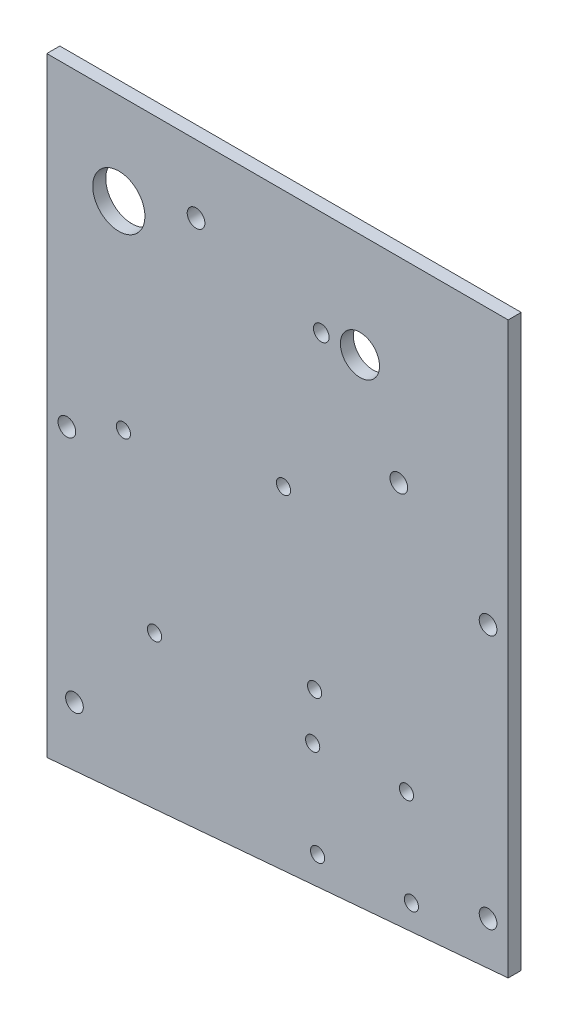
ISO-10303-21;
HEADER;
FILE_DESCRIPTION(('STEP AP214'),'2;1');
FILE_NAME('part.step','',(''),(''),'','','');
FILE_SCHEMA(('AUTOMOTIVE_DESIGN { 1 0 10303 214 1 1 1 1 }'));
ENDSEC;
DATA;
#1=APPLICATION_CONTEXT('core data for automotive mechanical design processes');
#2=APPLICATION_PROTOCOL_DEFINITION('international standard','automotive_design',2000,#1);
#3=PRODUCT_CONTEXT('',#1,'mechanical');
#4=PRODUCT('Part','Part','',(#3));
#5=PRODUCT_RELATED_PRODUCT_CATEGORY('part','',(#4));
#6=PRODUCT_DEFINITION_FORMATION('','',#4);
#7=PRODUCT_DEFINITION_CONTEXT('part definition',#1,'design');
#8=PRODUCT_DEFINITION('design','',#6,#7);
#9=PRODUCT_DEFINITION_SHAPE('','',#8);
#10=(LENGTH_UNIT() NAMED_UNIT(*) SI_UNIT(.MILLI.,.METRE.));
#11=(NAMED_UNIT(*) PLANE_ANGLE_UNIT() SI_UNIT($,.RADIAN.));
#12=(NAMED_UNIT(*) SI_UNIT($,.STERADIAN.) SOLID_ANGLE_UNIT());
#13=UNCERTAINTY_MEASURE_WITH_UNIT(LENGTH_MEASURE(1.E-05),#10,'distance_accuracy_value','');
#14=(GEOMETRIC_REPRESENTATION_CONTEXT(3) GLOBAL_UNCERTAINTY_ASSIGNED_CONTEXT((#13)) GLOBAL_UNIT_ASSIGNED_CONTEXT((#10,
#11,#12)) REPRESENTATION_CONTEXT('',''));
#15=CARTESIAN_POINT('',(0.,0.,0.));
#16=DIRECTION('',(0.,0.,1.));
#17=DIRECTION('',(1.,0.,0.));
#18=AXIS2_PLACEMENT_3D('',#15,#16,#17);
#19=CARTESIAN_POINT('',(112.268,-138.684,-3.175));
#20=DIRECTION('',(1.,0.,0.));
#21=DIRECTION('',(0.,1.,0.));
#22=AXIS2_PLACEMENT_3D('',#19,#20,#21);
#23=PLANE('',#22);
#24=DIRECTION('',(0.,1.,0.));
#25=VECTOR('',#24,1.);
#26=CARTESIAN_POINT('',(112.268,-138.684,0.));
#27=LINE('',#26,#25);
#28=CARTESIAN_POINT('',(112.268,-138.684,0.));
#29=VERTEX_POINT('',#28);
#30=CARTESIAN_POINT('',(112.268,0.,0.));
#31=VERTEX_POINT('',#30);
#32=EDGE_CURVE('E110',#29,#31,#27,.T.);
#33=ORIENTED_EDGE('',*,*,#32,.F.);
#34=DIRECTION('',(0.,0.,1.));
#35=VECTOR('',#34,1.);
#36=CARTESIAN_POINT('',(112.268,-138.684,-3.175));
#37=LINE('',#36,#35);
#38=CARTESIAN_POINT('',(112.268,-138.684,-3.175));
#39=VERTEX_POINT('',#38);
#40=EDGE_CURVE('E11',#39,#29,#37,.T.);
#41=ORIENTED_EDGE('',*,*,#40,.F.);
#42=DIRECTION('',(0.,1.,0.));
#43=VECTOR('',#42,1.);
#44=CARTESIAN_POINT('',(112.268,-138.684,-3.175));
#45=LINE('',#44,#43);
#46=CARTESIAN_POINT('',(112.268,0.,-3.175));
#47=VERTEX_POINT('',#46);
#48=EDGE_CURVE('E101',#39,#47,#45,.T.);
#49=ORIENTED_EDGE('',*,*,#48,.T.);
#50=DIRECTION('',(0.,0.,1.));
#51=VECTOR('',#50,1.);
#52=CARTESIAN_POINT('',(112.268,0.,-3.175));
#53=LINE('',#52,#51);
#54=EDGE_CURVE('E42',#47,#31,#53,.T.);
#55=ORIENTED_EDGE('',*,*,#54,.T.);
#56=EDGE_LOOP('',(#33,#41,#49,#55));
#57=FACE_BOUND('',#56,.T.);
#58=ADVANCED_FACE('F39',(#57),#23,.T.);
#59=CARTESIAN_POINT('',(0.,-148.336,-3.175));
#60=DIRECTION('',(0.0856568743177185,-0.996324696011355,0.));
#61=DIRECTION('',(0.996324696011355,0.0856568743177185,0.));
#62=AXIS2_PLACEMENT_3D('',#59,#60,#61);
#63=PLANE('',#62);
#64=DIRECTION('',(0.996324696011355,0.0856568743177185,0.));
#65=VECTOR('',#64,1.);
#66=CARTESIAN_POINT('',(0.,-148.336,0.));
#67=LINE('',#66,#65);
#68=CARTESIAN_POINT('',(0.,-148.336,0.));
#69=VERTEX_POINT('',#68);
#70=EDGE_CURVE('E104',#69,#29,#67,.T.);
#71=ORIENTED_EDGE('',*,*,#70,.F.);
#72=DIRECTION('',(0.,0.,1.));
#73=VECTOR('',#72,1.);
#74=CARTESIAN_POINT('',(0.,-148.336,-3.175));
#75=LINE('',#74,#73);
#76=CARTESIAN_POINT('',(0.,-148.336,-3.175));
#77=VERTEX_POINT('',#76);
#78=EDGE_CURVE('E49',#77,#69,#75,.T.);
#79=ORIENTED_EDGE('',*,*,#78,.F.);
#80=DIRECTION('',(0.996324696011355,0.0856568743177185,0.));
#81=VECTOR('',#80,1.);
#82=CARTESIAN_POINT('',(0.,-148.336,-3.175));
#83=LINE('',#82,#81);
#84=EDGE_CURVE('E96',#77,#39,#83,.T.);
#85=ORIENTED_EDGE('',*,*,#84,.T.);
#86=ORIENTED_EDGE('',*,*,#40,.T.);
#87=EDGE_LOOP('',(#71,#79,#85,#86));
#88=FACE_BOUND('',#87,.T.);
#89=ADVANCED_FACE('F127',(#88),#63,.T.);
#90=CARTESIAN_POINT('',(0.,0.,-3.175));
#91=DIRECTION('',(-1.,0.,0.));
#92=DIRECTION('',(0.,0.,1.));
#93=AXIS2_PLACEMENT_3D('',#90,#91,#92);
#94=PLANE('',#93);
#95=DIRECTION('',(0.,-1.,0.));
#96=VECTOR('',#95,1.);
#97=CARTESIAN_POINT('',(0.,0.,0.));
#98=LINE('',#97,#96);
#99=CARTESIAN_POINT('',(0.,0.,0.));
#100=VERTEX_POINT('',#99);
#101=EDGE_CURVE('E90',#100,#69,#98,.T.);
#102=ORIENTED_EDGE('',*,*,#101,.F.);
#103=DIRECTION('',(0.,0.,1.));
#104=VECTOR('',#103,1.);
#105=CARTESIAN_POINT('',(0.,0.,-3.175));
#106=LINE('',#105,#104);
#107=CARTESIAN_POINT('',(0.,0.,-3.175));
#108=VERTEX_POINT('',#107);
#109=EDGE_CURVE('E85',#108,#100,#106,.T.);
#110=ORIENTED_EDGE('',*,*,#109,.F.);
#111=DIRECTION('',(0.,-1.,0.));
#112=VECTOR('',#111,1.);
#113=CARTESIAN_POINT('',(0.,0.,-3.175));
#114=LINE('',#113,#112);
#115=EDGE_CURVE('E88',#108,#77,#114,.T.);
#116=ORIENTED_EDGE('',*,*,#115,.T.);
#117=ORIENTED_EDGE('',*,*,#78,.T.);
#118=EDGE_LOOP('',(#102,#110,#116,#117));
#119=FACE_BOUND('',#118,.T.);
#120=ADVANCED_FACE('F87',(#119),#94,.T.);
#121=CARTESIAN_POINT('',(112.268,0.,-3.175));
#122=DIRECTION('',(0.,1.,0.));
#123=DIRECTION('',(0.,0.,1.));
#124=AXIS2_PLACEMENT_3D('',#121,#122,#123);
#125=PLANE('',#124);
#126=DIRECTION('',(-1.,0.,0.));
#127=VECTOR('',#126,1.);
#128=CARTESIAN_POINT('',(112.268,0.,0.));
#129=LINE('',#128,#127);
#130=EDGE_CURVE('E114',#31,#100,#129,.T.);
#131=ORIENTED_EDGE('',*,*,#130,.F.);
#132=ORIENTED_EDGE('',*,*,#54,.F.);
#133=DIRECTION('',(-1.,0.,0.));
#134=VECTOR('',#133,1.);
#135=CARTESIAN_POINT('',(112.268,0.,-3.175));
#136=LINE('',#135,#134);
#137=EDGE_CURVE('E95',#47,#108,#136,.T.);
#138=ORIENTED_EDGE('',*,*,#137,.T.);
#139=ORIENTED_EDGE('',*,*,#109,.T.);
#140=EDGE_LOOP('',(#131,#132,#138,#139));
#141=FACE_BOUND('',#140,.T.);
#142=ADVANCED_FACE('F99',(#141),#125,.T.);
#143=CARTESIAN_POINT('',(0.,0.,-3.175));
#144=DIRECTION('',(0.,0.,1.));
#145=DIRECTION('',(1.,0.,0.));
#146=AXIS2_PLACEMENT_3D('',#143,#144,#145);
#147=PLANE('',#146);
#148=CARTESIAN_POINT('',(66.7920278286556,-25.4583547335072,-3.175));
#149=DIRECTION('',(0.,0.,-1.));
#150=DIRECTION('',(-1.,0.,0.));
#151=AXIS2_PLACEMENT_3D('',#148,#149,#150);
#152=CIRCLE('',#151,1.90500000000002);
#153=CARTESIAN_POINT('',(64.8870278286556,-25.4583547335072,-3.175));
#154=VERTEX_POINT('',#153);
#155=EDGE_CURVE('E223',#154,#154,#152,.T.);
#156=ORIENTED_EDGE('',*,*,#155,.F.);
#157=EDGE_LOOP('',(#156));
#158=FACE_BOUND('',#157,.T.);
#159=CARTESIAN_POINT('',(17.526,-22.352,-3.175));
#160=DIRECTION('',(0.,0.,1.));
#161=DIRECTION('',(1.,0.,0.));
#162=AXIS2_PLACEMENT_3D('',#159,#160,#161);
#163=CIRCLE('',#162,6.35);
#164=CARTESIAN_POINT('',(23.876,-22.352,-3.175));
#165=VERTEX_POINT('',#164);
#166=EDGE_CURVE('E233',#165,#165,#163,.T.);
#167=ORIENTED_EDGE('',*,*,#166,.T.);
#168=EDGE_LOOP('',(#167));
#169=FACE_BOUND('',#168,.T.);
#170=CARTESIAN_POINT('',(76.2,-25.4,-3.175));
#171=DIRECTION('',(0.,0.,1.));
#172=DIRECTION('',(1.,0.,0.));
#173=AXIS2_PLACEMENT_3D('',#170,#171,#172);
#174=CIRCLE('',#173,4.7625);
#175=CARTESIAN_POINT('',(80.9625,-25.4,-3.175));
#176=VERTEX_POINT('',#175);
#177=EDGE_CURVE('E241',#176,#176,#174,.T.);
#178=ORIENTED_EDGE('',*,*,#177,.T.);
#179=EDGE_LOOP('',(#178));
#180=FACE_BOUND('',#179,.T.);
#181=CARTESIAN_POINT('',(36.322,-16.51,-3.175));
#182=DIRECTION('',(0.,0.,1.));
#183=DIRECTION('',(1.,0.,0.));
#184=AXIS2_PLACEMENT_3D('',#181,#182,#183);
#185=CIRCLE('',#184,2.15265);
#186=CARTESIAN_POINT('',(38.47465,-16.51,-3.175));
#187=VERTEX_POINT('',#186);
#188=EDGE_CURVE('E249',#187,#187,#185,.T.);
#189=ORIENTED_EDGE('',*,*,#188,.T.);
#190=EDGE_LOOP('',(#189));
#191=FACE_BOUND('',#190,.T.);
#192=CARTESIAN_POINT('',(85.6615,-47.625,-3.175));
#193=DIRECTION('',(0.,0.,1.));
#194=DIRECTION('',(1.,0.,0.));
#195=AXIS2_PLACEMENT_3D('',#192,#193,#194);
#196=CIRCLE('',#195,2.15264999999999);
#197=CARTESIAN_POINT('',(87.81415,-47.625,-3.175));
#198=VERTEX_POINT('',#197);
#199=EDGE_CURVE('E257',#198,#198,#196,.T.);
#200=ORIENTED_EDGE('',*,*,#199,.T.);
#201=EDGE_LOOP('',(#200));
#202=FACE_BOUND('',#201,.T.);
#203=CARTESIAN_POINT('',(18.6444695764577,-70.032201580464,-3.175));
#204=DIRECTION('',(0.,0.,1.));
#205=DIRECTION('',(1.,0.,0.));
#206=AXIS2_PLACEMENT_3D('',#203,#204,#205);
#207=CIRCLE('',#206,1.72719999999999);
#208=CARTESIAN_POINT('',(20.3716695764577,-70.032201580464,-3.175));
#209=VERTEX_POINT('',#208);
#210=EDGE_CURVE('E265',#209,#209,#207,.T.);
#211=ORIENTED_EDGE('',*,*,#210,.T.);
#212=EDGE_LOOP('',(#211));
#213=FACE_BOUND('',#212,.T.);
#214=CARTESIAN_POINT('',(57.602798419536,-62.4594695764574,-3.175));
#215=DIRECTION('',(0.,0.,1.));
#216=DIRECTION('',(1.,0.,0.));
#217=AXIS2_PLACEMENT_3D('',#214,#215,#216);
#218=CIRCLE('',#217,1.7272);
#219=CARTESIAN_POINT('',(59.329998419536,-62.4594695764574,-3.175));
#220=VERTEX_POINT('',#219);
#221=EDGE_CURVE('E273',#220,#220,#218,.T.);
#222=ORIENTED_EDGE('',*,*,#221,.T.);
#223=EDGE_LOOP('',(#222));
#224=FACE_BOUND('',#223,.T.);
#225=CARTESIAN_POINT('',(65.1755304235415,-101.417798419535,-3.175));
#226=DIRECTION('',(0.,0.,1.));
#227=DIRECTION('',(1.,0.,0.));
#228=AXIS2_PLACEMENT_3D('',#225,#226,#227);
#229=CIRCLE('',#228,1.7272);
#230=CARTESIAN_POINT('',(66.9027304235415,-101.417798419535,-3.175));
#231=VERTEX_POINT('',#230);
#232=EDGE_CURVE('E281',#231,#231,#229,.T.);
#233=ORIENTED_EDGE('',*,*,#232,.T.);
#234=EDGE_LOOP('',(#233));
#235=FACE_BOUND('',#234,.T.);
#236=CARTESIAN_POINT('',(26.217201580465,-108.990530423541,-3.175));
#237=DIRECTION('',(0.,0.,1.));
#238=DIRECTION('',(1.,0.,0.));
#239=AXIS2_PLACEMENT_3D('',#236,#237,#238);
#240=CIRCLE('',#239,1.72719999999999);
#241=CARTESIAN_POINT('',(27.944401580465,-108.990530423541,-3.175));
#242=VERTEX_POINT('',#241);
#243=EDGE_CURVE('E289',#242,#242,#240,.T.);
#244=ORIENTED_EDGE('',*,*,#243,.T.);
#245=EDGE_LOOP('',(#244));
#246=FACE_BOUND('',#245,.T.);
#247=CARTESIAN_POINT('',(65.8918643976101,-135.8375355621,-3.175));
#248=DIRECTION('',(0.,0.,1.));
#249=DIRECTION('',(1.,0.,0.));
#250=AXIS2_PLACEMENT_3D('',#247,#248,#249);
#251=CIRCLE('',#250,1.7272);
#252=CARTESIAN_POINT('',(67.6190643976101,-135.8375355621,-3.175));
#253=VERTEX_POINT('',#252);
#254=EDGE_CURVE('E297',#253,#253,#251,.T.);
#255=ORIENTED_EDGE('',*,*,#254,.T.);
#256=EDGE_LOOP('',(#255));
#257=FACE_BOUND('',#256,.T.);
#258=CARTESIAN_POINT('',(88.7205355621015,-134.641135602388,-3.175));
#259=DIRECTION('',(0.,0.,1.));
#260=DIRECTION('',(1.,0.,0.));
#261=AXIS2_PLACEMENT_3D('',#258,#259,#260);
#262=CIRCLE('',#261,1.7272);
#263=CARTESIAN_POINT('',(90.4477355621015,-134.641135602388,-3.175));
#264=VERTEX_POINT('',#263);
#265=EDGE_CURVE('E305',#264,#264,#262,.T.);
#266=ORIENTED_EDGE('',*,*,#265,.T.);
#267=EDGE_LOOP('',(#266));
#268=FACE_BOUND('',#267,.T.);
#269=CARTESIAN_POINT('',(87.5241356023876,-111.812464437898,-3.175));
#270=DIRECTION('',(0.,0.,1.));
#271=DIRECTION('',(1.,0.,0.));
#272=AXIS2_PLACEMENT_3D('',#269,#270,#271);
#273=CIRCLE('',#272,1.7272);
#274=CARTESIAN_POINT('',(89.2513356023876,-111.812464437898,-3.175));
#275=VERTEX_POINT('',#274);
#276=EDGE_CURVE('E313',#275,#275,#273,.T.);
#277=ORIENTED_EDGE('',*,*,#276,.T.);
#278=EDGE_LOOP('',(#277));
#279=FACE_BOUND('',#278,.T.);
#280=CARTESIAN_POINT('',(64.6954644378985,-113.008864397612,-3.175));
#281=DIRECTION('',(0.,0.,1.));
#282=DIRECTION('',(1.,0.,0.));
#283=AXIS2_PLACEMENT_3D('',#280,#281,#282);
#284=CIRCLE('',#283,1.7272);
#285=CARTESIAN_POINT('',(66.4226644378984,-113.008864397612,-3.175));
#286=VERTEX_POINT('',#285);
#287=EDGE_CURVE('E321',#286,#286,#284,.T.);
#288=ORIENTED_EDGE('',*,*,#287,.T.);
#289=EDGE_LOOP('',(#288));
#290=FACE_BOUND('',#289,.T.);
#291=CARTESIAN_POINT('',(6.731,-133.35,-3.175));
#292=DIRECTION('',(0.,0.,1.));
#293=DIRECTION('',(1.,0.,0.));
#294=AXIS2_PLACEMENT_3D('',#291,#292,#293);
#295=CIRCLE('',#294,2.15265);
#296=CARTESIAN_POINT('',(8.88365,-133.35,-3.175));
#297=VERTEX_POINT('',#296);
#298=EDGE_CURVE('E329',#297,#297,#295,.T.);
#299=ORIENTED_EDGE('',*,*,#298,.T.);
#300=EDGE_LOOP('',(#299));
#301=FACE_BOUND('',#300,.T.);
#302=CARTESIAN_POINT('',(107.3785,-128.5875,-3.175));
#303=DIRECTION('',(0.,0.,1.));
#304=DIRECTION('',(1.,0.,0.));
#305=AXIS2_PLACEMENT_3D('',#302,#303,#304);
#306=CIRCLE('',#305,2.15264999999999);
#307=CARTESIAN_POINT('',(109.53115,-128.5875,-3.175));
#308=VERTEX_POINT('',#307);
#309=EDGE_CURVE('E337',#308,#308,#306,.T.);
#310=ORIENTED_EDGE('',*,*,#309,.T.);
#311=EDGE_LOOP('',(#310));
#312=FACE_BOUND('',#311,.T.);
#313=CARTESIAN_POINT('',(107.3785,-66.675,-3.175));
#314=DIRECTION('',(0.,0.,1.));
#315=DIRECTION('',(1.,0.,0.));
#316=AXIS2_PLACEMENT_3D('',#313,#314,#315);
#317=CIRCLE('',#316,2.15264999999999);
#318=CARTESIAN_POINT('',(109.53115,-66.675,-3.175));
#319=VERTEX_POINT('',#318);
#320=EDGE_CURVE('E345',#319,#319,#317,.T.);
#321=ORIENTED_EDGE('',*,*,#320,.T.);
#322=EDGE_LOOP('',(#321));
#323=FACE_BOUND('',#322,.T.);
#324=CARTESIAN_POINT('',(4.8895,-76.2,-3.175));
#325=DIRECTION('',(0.,0.,1.));
#326=DIRECTION('',(1.,0.,0.));
#327=AXIS2_PLACEMENT_3D('',#324,#325,#326);
#328=CIRCLE('',#327,2.15265);
#329=CARTESIAN_POINT('',(7.04215,-76.2,-3.175));
#330=VERTEX_POINT('',#329);
#331=EDGE_CURVE('E115',#330,#330,#328,.T.);
#332=ORIENTED_EDGE('',*,*,#331,.T.);
#333=EDGE_LOOP('',(#332));
#334=FACE_BOUND('',#333,.T.);
#335=ORIENTED_EDGE('',*,*,#48,.F.);
#336=ORIENTED_EDGE('',*,*,#84,.F.);
#337=ORIENTED_EDGE('',*,*,#115,.F.);
#338=ORIENTED_EDGE('',*,*,#137,.F.);
#339=EDGE_LOOP('',(#335,#336,#337,#338));
#340=FACE_BOUND('',#339,.T.);
#341=ADVANCED_FACE('F94',(#158,#169,#180,#191,#202,#213,#224,#235,#246,#257,#268,#279,#290,#301,
#312,#323,#334,#340),#147,.F.);
#342=CARTESIAN_POINT('',(0.,0.,0.));
#343=DIRECTION('',(0.,0.,1.));
#344=DIRECTION('',(1.,0.,0.));
#345=AXIS2_PLACEMENT_3D('',#342,#343,#344);
#346=PLANE('',#345);
#347=CARTESIAN_POINT('',(66.7920278286556,-25.4583547335072,0.));
#348=DIRECTION('',(0.,0.,-1.));
#349=DIRECTION('',(-1.,0.,0.));
#350=AXIS2_PLACEMENT_3D('',#347,#348,#349);
#351=CIRCLE('',#350,1.90500000000002);
#352=CARTESIAN_POINT('',(64.8870278286556,-25.4583547335072,0.));
#353=VERTEX_POINT('',#352);
#354=EDGE_CURVE('E221',#353,#353,#351,.T.);
#355=ORIENTED_EDGE('',*,*,#354,.T.);
#356=EDGE_LOOP('',(#355));
#357=FACE_BOUND('',#356,.T.);
#358=CARTESIAN_POINT('',(17.526,-22.352,0.));
#359=DIRECTION('',(0.,0.,1.));
#360=DIRECTION('',(1.,0.,0.));
#361=AXIS2_PLACEMENT_3D('',#358,#359,#360);
#362=CIRCLE('',#361,6.35);
#363=CARTESIAN_POINT('',(23.876,-22.352,0.));
#364=VERTEX_POINT('',#363);
#365=EDGE_CURVE('E227',#364,#364,#362,.T.);
#366=ORIENTED_EDGE('',*,*,#365,.F.);
#367=EDGE_LOOP('',(#366));
#368=FACE_BOUND('',#367,.T.);
#369=CARTESIAN_POINT('',(76.2,-25.4,0.));
#370=DIRECTION('',(0.,0.,1.));
#371=DIRECTION('',(1.,0.,0.));
#372=AXIS2_PLACEMENT_3D('',#369,#370,#371);
#373=CIRCLE('',#372,4.7625);
#374=CARTESIAN_POINT('',(80.9625,-25.4,0.));
#375=VERTEX_POINT('',#374);
#376=EDGE_CURVE('E237',#375,#375,#373,.T.);
#377=ORIENTED_EDGE('',*,*,#376,.F.);
#378=EDGE_LOOP('',(#377));
#379=FACE_BOUND('',#378,.T.);
#380=CARTESIAN_POINT('',(36.322,-16.51,0.));
#381=DIRECTION('',(0.,0.,1.));
#382=DIRECTION('',(1.,0.,0.));
#383=AXIS2_PLACEMENT_3D('',#380,#381,#382);
#384=CIRCLE('',#383,2.15265);
#385=CARTESIAN_POINT('',(38.47465,-16.51,0.));
#386=VERTEX_POINT('',#385);
#387=EDGE_CURVE('E245',#386,#386,#384,.T.);
#388=ORIENTED_EDGE('',*,*,#387,.F.);
#389=EDGE_LOOP('',(#388));
#390=FACE_BOUND('',#389,.T.);
#391=CARTESIAN_POINT('',(85.6615,-47.625,0.));
#392=DIRECTION('',(0.,0.,1.));
#393=DIRECTION('',(1.,0.,0.));
#394=AXIS2_PLACEMENT_3D('',#391,#392,#393);
#395=CIRCLE('',#394,2.15264999999999);
#396=CARTESIAN_POINT('',(87.81415,-47.625,0.));
#397=VERTEX_POINT('',#396);
#398=EDGE_CURVE('E253',#397,#397,#395,.T.);
#399=ORIENTED_EDGE('',*,*,#398,.F.);
#400=EDGE_LOOP('',(#399));
#401=FACE_BOUND('',#400,.T.);
#402=CARTESIAN_POINT('',(18.6444695764577,-70.032201580464,0.));
#403=DIRECTION('',(0.,0.,1.));
#404=DIRECTION('',(1.,0.,0.));
#405=AXIS2_PLACEMENT_3D('',#402,#403,#404);
#406=CIRCLE('',#405,1.7272);
#407=CARTESIAN_POINT('',(20.3716695764577,-70.032201580464,0.));
#408=VERTEX_POINT('',#407);
#409=EDGE_CURVE('E261',#408,#408,#406,.T.);
#410=ORIENTED_EDGE('',*,*,#409,.F.);
#411=EDGE_LOOP('',(#410));
#412=FACE_BOUND('',#411,.T.);
#413=CARTESIAN_POINT('',(57.602798419536,-62.4594695764574,0.));
#414=DIRECTION('',(0.,0.,1.));
#415=DIRECTION('',(1.,0.,0.));
#416=AXIS2_PLACEMENT_3D('',#413,#414,#415);
#417=CIRCLE('',#416,1.7272);
#418=CARTESIAN_POINT('',(59.329998419536,-62.4594695764574,0.));
#419=VERTEX_POINT('',#418);
#420=EDGE_CURVE('E269',#419,#419,#417,.T.);
#421=ORIENTED_EDGE('',*,*,#420,.F.);
#422=EDGE_LOOP('',(#421));
#423=FACE_BOUND('',#422,.T.);
#424=CARTESIAN_POINT('',(65.1755304235415,-101.417798419535,0.));
#425=DIRECTION('',(0.,0.,1.));
#426=DIRECTION('',(1.,0.,0.));
#427=AXIS2_PLACEMENT_3D('',#424,#425,#426);
#428=CIRCLE('',#427,1.7272);
#429=CARTESIAN_POINT('',(66.9027304235415,-101.417798419535,0.));
#430=VERTEX_POINT('',#429);
#431=EDGE_CURVE('E277',#430,#430,#428,.T.);
#432=ORIENTED_EDGE('',*,*,#431,.F.);
#433=EDGE_LOOP('',(#432));
#434=FACE_BOUND('',#433,.T.);
#435=CARTESIAN_POINT('',(26.217201580465,-108.990530423541,0.));
#436=DIRECTION('',(0.,0.,1.));
#437=DIRECTION('',(1.,0.,0.));
#438=AXIS2_PLACEMENT_3D('',#435,#436,#437);
#439=CIRCLE('',#438,1.7272);
#440=CARTESIAN_POINT('',(27.944401580465,-108.990530423541,0.));
#441=VERTEX_POINT('',#440);
#442=EDGE_CURVE('E285',#441,#441,#439,.T.);
#443=ORIENTED_EDGE('',*,*,#442,.F.);
#444=EDGE_LOOP('',(#443));
#445=FACE_BOUND('',#444,.T.);
#446=CARTESIAN_POINT('',(65.8918643976101,-135.8375355621,0.));
#447=DIRECTION('',(0.,0.,1.));
#448=DIRECTION('',(1.,0.,0.));
#449=AXIS2_PLACEMENT_3D('',#446,#447,#448);
#450=CIRCLE('',#449,1.7272);
#451=CARTESIAN_POINT('',(67.6190643976101,-135.8375355621,0.));
#452=VERTEX_POINT('',#451);
#453=EDGE_CURVE('E293',#452,#452,#450,.T.);
#454=ORIENTED_EDGE('',*,*,#453,.F.);
#455=EDGE_LOOP('',(#454));
#456=FACE_BOUND('',#455,.T.);
#457=CARTESIAN_POINT('',(88.7205355621015,-134.641135602388,0.));
#458=DIRECTION('',(0.,0.,1.));
#459=DIRECTION('',(1.,0.,0.));
#460=AXIS2_PLACEMENT_3D('',#457,#458,#459);
#461=CIRCLE('',#460,1.7272);
#462=CARTESIAN_POINT('',(90.4477355621015,-134.641135602388,0.));
#463=VERTEX_POINT('',#462);
#464=EDGE_CURVE('E301',#463,#463,#461,.T.);
#465=ORIENTED_EDGE('',*,*,#464,.F.);
#466=EDGE_LOOP('',(#465));
#467=FACE_BOUND('',#466,.T.);
#468=CARTESIAN_POINT('',(87.5241356023876,-111.812464437898,0.));
#469=DIRECTION('',(0.,0.,1.));
#470=DIRECTION('',(1.,0.,0.));
#471=AXIS2_PLACEMENT_3D('',#468,#469,#470);
#472=CIRCLE('',#471,1.7272);
#473=CARTESIAN_POINT('',(89.2513356023876,-111.812464437898,0.));
#474=VERTEX_POINT('',#473);
#475=EDGE_CURVE('E309',#474,#474,#472,.T.);
#476=ORIENTED_EDGE('',*,*,#475,.F.);
#477=EDGE_LOOP('',(#476));
#478=FACE_BOUND('',#477,.T.);
#479=CARTESIAN_POINT('',(64.6954644378985,-113.008864397612,0.));
#480=DIRECTION('',(0.,0.,1.));
#481=DIRECTION('',(1.,0.,0.));
#482=AXIS2_PLACEMENT_3D('',#479,#480,#481);
#483=CIRCLE('',#482,1.7272);
#484=CARTESIAN_POINT('',(66.4226644378984,-113.008864397612,0.));
#485=VERTEX_POINT('',#484);
#486=EDGE_CURVE('E317',#485,#485,#483,.T.);
#487=ORIENTED_EDGE('',*,*,#486,.F.);
#488=EDGE_LOOP('',(#487));
#489=FACE_BOUND('',#488,.T.);
#490=CARTESIAN_POINT('',(6.731,-133.35,0.));
#491=DIRECTION('',(0.,0.,1.));
#492=DIRECTION('',(1.,0.,0.));
#493=AXIS2_PLACEMENT_3D('',#490,#491,#492);
#494=CIRCLE('',#493,2.15264999999999);
#495=CARTESIAN_POINT('',(8.88364999999999,-133.35,0.));
#496=VERTEX_POINT('',#495);
#497=EDGE_CURVE('E325',#496,#496,#494,.T.);
#498=ORIENTED_EDGE('',*,*,#497,.F.);
#499=EDGE_LOOP('',(#498));
#500=FACE_BOUND('',#499,.T.);
#501=CARTESIAN_POINT('',(107.3785,-128.5875,0.));
#502=DIRECTION('',(0.,0.,1.));
#503=DIRECTION('',(1.,0.,0.));
#504=AXIS2_PLACEMENT_3D('',#501,#502,#503);
#505=CIRCLE('',#504,2.15264999999999);
#506=CARTESIAN_POINT('',(109.53115,-128.5875,0.));
#507=VERTEX_POINT('',#506);
#508=EDGE_CURVE('E333',#507,#507,#505,.T.);
#509=ORIENTED_EDGE('',*,*,#508,.F.);
#510=EDGE_LOOP('',(#509));
#511=FACE_BOUND('',#510,.T.);
#512=CARTESIAN_POINT('',(107.3785,-66.675,0.));
#513=DIRECTION('',(0.,0.,1.));
#514=DIRECTION('',(1.,0.,0.));
#515=AXIS2_PLACEMENT_3D('',#512,#513,#514);
#516=CIRCLE('',#515,2.15264999999999);
#517=CARTESIAN_POINT('',(109.53115,-66.675,0.));
#518=VERTEX_POINT('',#517);
#519=EDGE_CURVE('E341',#518,#518,#516,.T.);
#520=ORIENTED_EDGE('',*,*,#519,.F.);
#521=EDGE_LOOP('',(#520));
#522=FACE_BOUND('',#521,.T.);
#523=CARTESIAN_POINT('',(4.8895,-76.2,0.));
#524=DIRECTION('',(0.,0.,1.));
#525=DIRECTION('',(1.,0.,0.));
#526=AXIS2_PLACEMENT_3D('',#523,#524,#525);
#527=CIRCLE('',#526,2.15264999999999);
#528=CARTESIAN_POINT('',(7.04214999999999,-76.2,0.));
#529=VERTEX_POINT('',#528);
#530=EDGE_CURVE('E349',#529,#529,#527,.T.);
#531=ORIENTED_EDGE('',*,*,#530,.F.);
#532=EDGE_LOOP('',(#531));
#533=FACE_BOUND('',#532,.T.);
#534=ORIENTED_EDGE('',*,*,#32,.T.);
#535=ORIENTED_EDGE('',*,*,#130,.T.);
#536=ORIENTED_EDGE('',*,*,#101,.T.);
#537=ORIENTED_EDGE('',*,*,#70,.T.);
#538=EDGE_LOOP('',(#534,#535,#536,#537));
#539=FACE_BOUND('',#538,.T.);
#540=ADVANCED_FACE('F126',(#357,#368,#379,#390,#401,#412,#423,#434,#445,#456,#467,#478,#489,
#500,#511,#522,#533,#539),#346,.T.);
#541=CARTESIAN_POINT('',(4.8895,-76.2,0.));
#542=DIRECTION('',(0.,0.,1.));
#543=DIRECTION('',(1.,0.,0.));
#544=AXIS2_PLACEMENT_3D('',#541,#542,#543);
#545=CYLINDRICAL_SURFACE('',#544,2.15264999999999);
#546=ORIENTED_EDGE('',*,*,#331,.F.);
#547=EDGE_LOOP('',(#546));
#548=FACE_BOUND('',#547,.T.);
#549=ORIENTED_EDGE('',*,*,#530,.T.);
#550=EDGE_LOOP('',(#549));
#551=FACE_BOUND('',#550,.T.);
#552=ADVANCED_FACE('F145',(#548,#551),#545,.F.);
#553=CARTESIAN_POINT('',(107.3785,-66.675,0.));
#554=DIRECTION('',(0.,0.,1.));
#555=DIRECTION('',(1.,0.,0.));
#556=AXIS2_PLACEMENT_3D('',#553,#554,#555);
#557=CYLINDRICAL_SURFACE('',#556,2.15264999999999);
#558=ORIENTED_EDGE('',*,*,#320,.F.);
#559=EDGE_LOOP('',(#558));
#560=FACE_BOUND('',#559,.T.);
#561=ORIENTED_EDGE('',*,*,#519,.T.);
#562=EDGE_LOOP('',(#561));
#563=FACE_BOUND('',#562,.T.);
#564=ADVANCED_FACE('F152',(#560,#563),#557,.F.);
#565=CARTESIAN_POINT('',(107.3785,-128.5875,0.));
#566=DIRECTION('',(0.,0.,1.));
#567=DIRECTION('',(1.,0.,0.));
#568=AXIS2_PLACEMENT_3D('',#565,#566,#567);
#569=CYLINDRICAL_SURFACE('',#568,2.15264999999999);
#570=ORIENTED_EDGE('',*,*,#309,.F.);
#571=EDGE_LOOP('',(#570));
#572=FACE_BOUND('',#571,.T.);
#573=ORIENTED_EDGE('',*,*,#508,.T.);
#574=EDGE_LOOP('',(#573));
#575=FACE_BOUND('',#574,.T.);
#576=ADVANCED_FACE('F156',(#572,#575),#569,.F.);
#577=CARTESIAN_POINT('',(6.731,-133.35,0.));
#578=DIRECTION('',(0.,0.,1.));
#579=DIRECTION('',(1.,0.,0.));
#580=AXIS2_PLACEMENT_3D('',#577,#578,#579);
#581=CYLINDRICAL_SURFACE('',#580,2.15264999999999);
#582=ORIENTED_EDGE('',*,*,#298,.F.);
#583=EDGE_LOOP('',(#582));
#584=FACE_BOUND('',#583,.T.);
#585=ORIENTED_EDGE('',*,*,#497,.T.);
#586=EDGE_LOOP('',(#585));
#587=FACE_BOUND('',#586,.T.);
#588=ADVANCED_FACE('F160',(#584,#587),#581,.F.);
#589=CARTESIAN_POINT('',(64.6954644378985,-113.008864397612,0.));
#590=DIRECTION('',(0.,0.,1.));
#591=DIRECTION('',(1.,0.,0.));
#592=AXIS2_PLACEMENT_3D('',#589,#590,#591);
#593=CYLINDRICAL_SURFACE('',#592,1.7272);
#594=ORIENTED_EDGE('',*,*,#287,.F.);
#595=EDGE_LOOP('',(#594));
#596=FACE_BOUND('',#595,.T.);
#597=ORIENTED_EDGE('',*,*,#486,.T.);
#598=EDGE_LOOP('',(#597));
#599=FACE_BOUND('',#598,.T.);
#600=ADVANCED_FACE('F164',(#596,#599),#593,.F.);
#601=CARTESIAN_POINT('',(87.5241356023876,-111.812464437898,0.));
#602=DIRECTION('',(0.,0.,1.));
#603=DIRECTION('',(1.,0.,0.));
#604=AXIS2_PLACEMENT_3D('',#601,#602,#603);
#605=CYLINDRICAL_SURFACE('',#604,1.7272);
#606=ORIENTED_EDGE('',*,*,#276,.F.);
#607=EDGE_LOOP('',(#606));
#608=FACE_BOUND('',#607,.T.);
#609=ORIENTED_EDGE('',*,*,#475,.T.);
#610=EDGE_LOOP('',(#609));
#611=FACE_BOUND('',#610,.T.);
#612=ADVANCED_FACE('F168',(#608,#611),#605,.F.);
#613=CARTESIAN_POINT('',(88.7205355621015,-134.641135602388,0.));
#614=DIRECTION('',(0.,0.,1.));
#615=DIRECTION('',(1.,0.,0.));
#616=AXIS2_PLACEMENT_3D('',#613,#614,#615);
#617=CYLINDRICAL_SURFACE('',#616,1.7272);
#618=ORIENTED_EDGE('',*,*,#265,.F.);
#619=EDGE_LOOP('',(#618));
#620=FACE_BOUND('',#619,.T.);
#621=ORIENTED_EDGE('',*,*,#464,.T.);
#622=EDGE_LOOP('',(#621));
#623=FACE_BOUND('',#622,.T.);
#624=ADVANCED_FACE('F172',(#620,#623),#617,.F.);
#625=CARTESIAN_POINT('',(65.8918643976101,-135.8375355621,0.));
#626=DIRECTION('',(0.,0.,1.));
#627=DIRECTION('',(1.,0.,0.));
#628=AXIS2_PLACEMENT_3D('',#625,#626,#627);
#629=CYLINDRICAL_SURFACE('',#628,1.7272);
#630=ORIENTED_EDGE('',*,*,#254,.F.);
#631=EDGE_LOOP('',(#630));
#632=FACE_BOUND('',#631,.T.);
#633=ORIENTED_EDGE('',*,*,#453,.T.);
#634=EDGE_LOOP('',(#633));
#635=FACE_BOUND('',#634,.T.);
#636=ADVANCED_FACE('F176',(#632,#635),#629,.F.);
#637=CARTESIAN_POINT('',(26.217201580465,-108.990530423541,0.));
#638=DIRECTION('',(0.,0.,1.));
#639=DIRECTION('',(1.,0.,0.));
#640=AXIS2_PLACEMENT_3D('',#637,#638,#639);
#641=CYLINDRICAL_SURFACE('',#640,1.7272);
#642=ORIENTED_EDGE('',*,*,#243,.F.);
#643=EDGE_LOOP('',(#642));
#644=FACE_BOUND('',#643,.T.);
#645=ORIENTED_EDGE('',*,*,#442,.T.);
#646=EDGE_LOOP('',(#645));
#647=FACE_BOUND('',#646,.T.);
#648=ADVANCED_FACE('F180',(#644,#647),#641,.F.);
#649=CARTESIAN_POINT('',(65.1755304235415,-101.417798419535,0.));
#650=DIRECTION('',(0.,0.,1.));
#651=DIRECTION('',(1.,0.,0.));
#652=AXIS2_PLACEMENT_3D('',#649,#650,#651);
#653=CYLINDRICAL_SURFACE('',#652,1.7272);
#654=ORIENTED_EDGE('',*,*,#232,.F.);
#655=EDGE_LOOP('',(#654));
#656=FACE_BOUND('',#655,.T.);
#657=ORIENTED_EDGE('',*,*,#431,.T.);
#658=EDGE_LOOP('',(#657));
#659=FACE_BOUND('',#658,.T.);
#660=ADVANCED_FACE('F184',(#656,#659),#653,.F.);
#661=CARTESIAN_POINT('',(57.602798419536,-62.4594695764574,0.));
#662=DIRECTION('',(0.,0.,1.));
#663=DIRECTION('',(1.,0.,0.));
#664=AXIS2_PLACEMENT_3D('',#661,#662,#663);
#665=CYLINDRICAL_SURFACE('',#664,1.7272);
#666=ORIENTED_EDGE('',*,*,#221,.F.);
#667=EDGE_LOOP('',(#666));
#668=FACE_BOUND('',#667,.T.);
#669=ORIENTED_EDGE('',*,*,#420,.T.);
#670=EDGE_LOOP('',(#669));
#671=FACE_BOUND('',#670,.T.);
#672=ADVANCED_FACE('F188',(#668,#671),#665,.F.);
#673=CARTESIAN_POINT('',(18.6444695764577,-70.032201580464,0.));
#674=DIRECTION('',(0.,0.,1.));
#675=DIRECTION('',(1.,0.,0.));
#676=AXIS2_PLACEMENT_3D('',#673,#674,#675);
#677=CYLINDRICAL_SURFACE('',#676,1.7272);
#678=ORIENTED_EDGE('',*,*,#210,.F.);
#679=EDGE_LOOP('',(#678));
#680=FACE_BOUND('',#679,.T.);
#681=ORIENTED_EDGE('',*,*,#409,.T.);
#682=EDGE_LOOP('',(#681));
#683=FACE_BOUND('',#682,.T.);
#684=ADVANCED_FACE('F192',(#680,#683),#677,.F.);
#685=CARTESIAN_POINT('',(85.6615,-47.625,0.));
#686=DIRECTION('',(0.,0.,1.));
#687=DIRECTION('',(1.,0.,0.));
#688=AXIS2_PLACEMENT_3D('',#685,#686,#687);
#689=CYLINDRICAL_SURFACE('',#688,2.15264999999999);
#690=ORIENTED_EDGE('',*,*,#199,.F.);
#691=EDGE_LOOP('',(#690));
#692=FACE_BOUND('',#691,.T.);
#693=ORIENTED_EDGE('',*,*,#398,.T.);
#694=EDGE_LOOP('',(#693));
#695=FACE_BOUND('',#694,.T.);
#696=ADVANCED_FACE('F196',(#692,#695),#689,.F.);
#697=CARTESIAN_POINT('',(36.322,-16.51,0.));
#698=DIRECTION('',(0.,0.,1.));
#699=DIRECTION('',(1.,0.,0.));
#700=AXIS2_PLACEMENT_3D('',#697,#698,#699);
#701=CYLINDRICAL_SURFACE('',#700,2.15265);
#702=ORIENTED_EDGE('',*,*,#188,.F.);
#703=EDGE_LOOP('',(#702));
#704=FACE_BOUND('',#703,.T.);
#705=ORIENTED_EDGE('',*,*,#387,.T.);
#706=EDGE_LOOP('',(#705));
#707=FACE_BOUND('',#706,.T.);
#708=ADVANCED_FACE('F200',(#704,#707),#701,.F.);
#709=CARTESIAN_POINT('',(76.2,-25.4,0.));
#710=DIRECTION('',(0.,0.,1.));
#711=DIRECTION('',(1.,0.,0.));
#712=AXIS2_PLACEMENT_3D('',#709,#710,#711);
#713=CYLINDRICAL_SURFACE('',#712,4.7625);
#714=ORIENTED_EDGE('',*,*,#177,.F.);
#715=EDGE_LOOP('',(#714));
#716=FACE_BOUND('',#715,.T.);
#717=ORIENTED_EDGE('',*,*,#376,.T.);
#718=EDGE_LOOP('',(#717));
#719=FACE_BOUND('',#718,.T.);
#720=ADVANCED_FACE('F204',(#716,#719),#713,.F.);
#721=CARTESIAN_POINT('',(17.526,-22.352,0.));
#722=DIRECTION('',(0.,0.,1.));
#723=DIRECTION('',(1.,0.,0.));
#724=AXIS2_PLACEMENT_3D('',#721,#722,#723);
#725=CYLINDRICAL_SURFACE('',#724,6.35);
#726=ORIENTED_EDGE('',*,*,#166,.F.);
#727=EDGE_LOOP('',(#726));
#728=FACE_BOUND('',#727,.T.);
#729=ORIENTED_EDGE('',*,*,#365,.T.);
#730=EDGE_LOOP('',(#729));
#731=FACE_BOUND('',#730,.T.);
#732=ADVANCED_FACE('F208',(#728,#731),#725,.F.);
#733=CARTESIAN_POINT('',(66.7920278286556,-25.4583547335072,-3.175));
#734=DIRECTION('',(0.,0.,-1.));
#735=DIRECTION('',(-1.,0.,0.));
#736=AXIS2_PLACEMENT_3D('',#733,#734,#735);
#737=CYLINDRICAL_SURFACE('',#736,1.90500000000002);
#738=ORIENTED_EDGE('',*,*,#354,.F.);
#739=EDGE_LOOP('',(#738));
#740=FACE_BOUND('',#739,.T.);
#741=ORIENTED_EDGE('',*,*,#155,.T.);
#742=EDGE_LOOP('',(#741));
#743=FACE_BOUND('',#742,.T.);
#744=ADVANCED_FACE('F212',(#740,#743),#737,.F.);
#745=CLOSED_SHELL('',(#58,#89,#120,#142,#341,#540,#552,#564,#576,#588,#600,#612,#624,#636,#648,
#660,#672,#684,#696,#708,#720,#732,#744));
#746=MANIFOLD_SOLID_BREP('B2',#745);
#747=ADVANCED_BREP_SHAPE_REPRESENTATION('',(#18,#746),#14);
#748=SHAPE_DEFINITION_REPRESENTATION(#9,#747);
ENDSEC;
END-ISO-10303-21;
